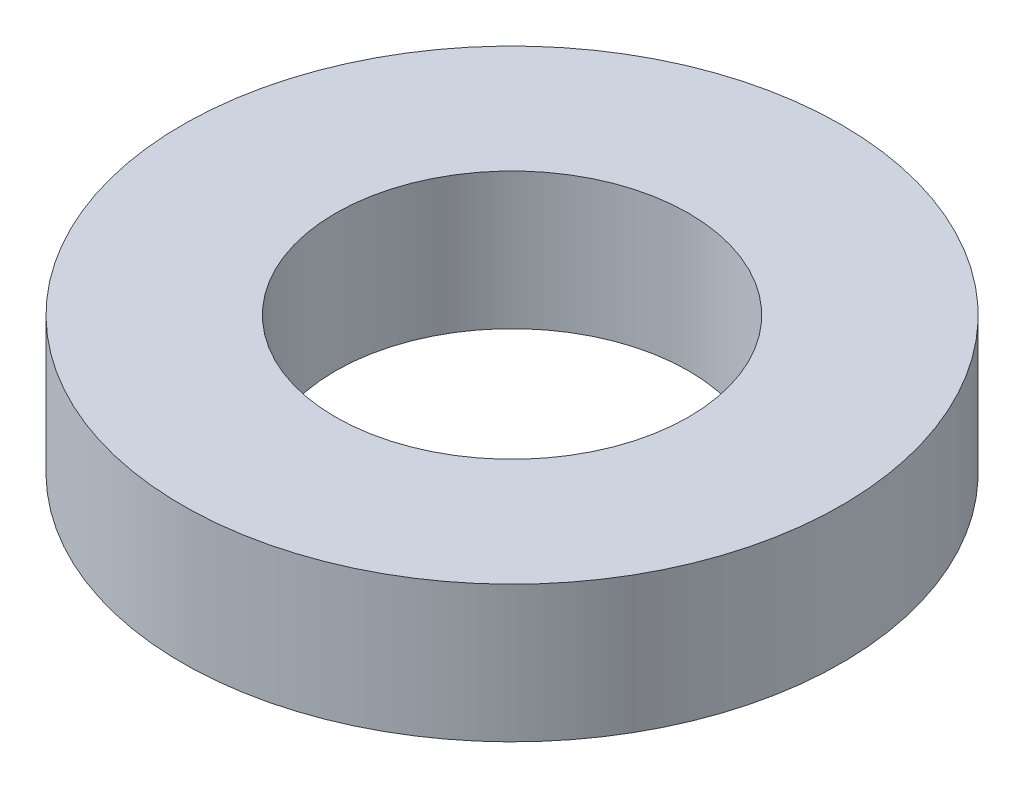
ISO-10303-21;
HEADER;
FILE_DESCRIPTION(('STEP AP214'),'2;1');
FILE_NAME('part.step','',(''),(''),'','','');
FILE_SCHEMA(('AUTOMOTIVE_DESIGN { 1 0 10303 214 1 1 1 1 }'));
ENDSEC;
DATA;
#1=APPLICATION_CONTEXT('core data for automotive mechanical design processes');
#2=APPLICATION_PROTOCOL_DEFINITION('international standard','automotive_design',2000,#1);
#3=PRODUCT_CONTEXT('',#1,'mechanical');
#4=PRODUCT('Part','Part','',(#3));
#5=PRODUCT_RELATED_PRODUCT_CATEGORY('part','',(#4));
#6=PRODUCT_DEFINITION_FORMATION('','',#4);
#7=PRODUCT_DEFINITION_CONTEXT('part definition',#1,'design');
#8=PRODUCT_DEFINITION('design','',#6,#7);
#9=PRODUCT_DEFINITION_SHAPE('','',#8);
#10=(LENGTH_UNIT() NAMED_UNIT(*) SI_UNIT(.MILLI.,.METRE.));
#11=(NAMED_UNIT(*) PLANE_ANGLE_UNIT() SI_UNIT($,.RADIAN.));
#12=(NAMED_UNIT(*) SI_UNIT($,.STERADIAN.) SOLID_ANGLE_UNIT());
#13=UNCERTAINTY_MEASURE_WITH_UNIT(LENGTH_MEASURE(1.E-05),#10,'distance_accuracy_value','');
#14=(GEOMETRIC_REPRESENTATION_CONTEXT(3) GLOBAL_UNCERTAINTY_ASSIGNED_CONTEXT((#13)) GLOBAL_UNIT_ASSIGNED_CONTEXT((#10,
#11,#12)) REPRESENTATION_CONTEXT('',''));
#15=CARTESIAN_POINT('',(0.,0.,0.));
#16=DIRECTION('',(0.,0.,1.));
#17=DIRECTION('',(1.,0.,0.));
#18=AXIS2_PLACEMENT_3D('',#15,#16,#17);
#19=CARTESIAN_POINT('',(0.,29.,0.));
#20=DIRECTION('',(0.,-1.,0.));
#21=DIRECTION('',(0.,0.,-1.));
#22=AXIS2_PLACEMENT_3D('',#19,#20,#21);
#23=CYLINDRICAL_SURFACE('',#22,70.);
#24=CARTESIAN_POINT('',(0.,29.,0.));
#25=DIRECTION('',(0.,1.,0.));
#26=DIRECTION('',(0.,0.,1.));
#27=AXIS2_PLACEMENT_3D('',#24,#25,#26);
#28=CIRCLE('',#27,70.);
#29=CARTESIAN_POINT('',(0.,29.,-70.));
#30=VERTEX_POINT('',#29);
#31=EDGE_CURVE('E10',#30,#30,#28,.T.);
#32=CARTESIAN_POINT('',(0.,0.,0.));
#33=DIRECTION('',(0.,1.,0.));
#34=DIRECTION('',(0.,0.,1.));
#35=AXIS2_PLACEMENT_3D('',#32,#33,#34);
#36=CIRCLE('',#35,70.);
#37=CARTESIAN_POINT('',(0.,0.,-70.));
#38=VERTEX_POINT('',#37);
#39=EDGE_CURVE('E37',#38,#38,#36,.T.);
#40=CARTESIAN_POINT('',(0.,29.,-70.));
#41=CARTESIAN_POINT('',(0.,28.6979166666667,-70.));
#42=CARTESIAN_POINT('',(0.,28.3958333333333,-70.));
#43=CARTESIAN_POINT('',(0.,27.7916666666667,-70.));
#44=CARTESIAN_POINT('',(0.,27.4895833333333,-70.));
#45=CARTESIAN_POINT('',(0.,26.8854166666667,-70.));
#46=CARTESIAN_POINT('',(0.,26.5833333333333,-70.));
#47=CARTESIAN_POINT('',(0.,25.9791666666667,-70.));
#48=CARTESIAN_POINT('',(0.,25.6770833333333,-70.));
#49=CARTESIAN_POINT('',(0.,25.0729166666667,-70.));
#50=CARTESIAN_POINT('',(0.,24.7708333333333,-70.));
#51=CARTESIAN_POINT('',(0.,24.1666666666667,-70.));
#52=CARTESIAN_POINT('',(0.,23.8645833333333,-70.));
#53=CARTESIAN_POINT('',(0.,23.2604166666667,-70.));
#54=CARTESIAN_POINT('',(0.,22.9583333333333,-70.));
#55=CARTESIAN_POINT('',(0.,22.3541666666667,-70.));
#56=CARTESIAN_POINT('',(0.,22.0520833333333,-70.));
#57=CARTESIAN_POINT('',(0.,21.4479166666667,-70.));
#58=CARTESIAN_POINT('',(0.,21.1458333333333,-70.));
#59=CARTESIAN_POINT('',(0.,20.5416666666667,-70.));
#60=CARTESIAN_POINT('',(0.,20.2395833333333,-70.));
#61=CARTESIAN_POINT('',(0.,19.6354166666667,-70.));
#62=CARTESIAN_POINT('',(0.,19.3333333333333,-70.));
#63=CARTESIAN_POINT('',(0.,18.7291666666667,-70.));
#64=CARTESIAN_POINT('',(0.,18.4270833333333,-70.));
#65=CARTESIAN_POINT('',(0.,17.8229166666667,-70.));
#66=CARTESIAN_POINT('',(0.,17.5208333333333,-70.));
#67=CARTESIAN_POINT('',(0.,16.9166666666667,-70.));
#68=CARTESIAN_POINT('',(0.,16.6145833333333,-70.));
#69=CARTESIAN_POINT('',(0.,16.0104166666667,-70.));
#70=CARTESIAN_POINT('',(0.,15.7083333333333,-70.));
#71=CARTESIAN_POINT('',(0.,15.1041666666667,-70.));
#72=CARTESIAN_POINT('',(0.,14.8020833333333,-70.));
#73=CARTESIAN_POINT('',(0.,14.1979166666667,-70.));
#74=CARTESIAN_POINT('',(0.,13.8958333333333,-70.));
#75=CARTESIAN_POINT('',(0.,13.2916666666667,-70.));
#76=CARTESIAN_POINT('',(0.,12.9895833333333,-70.));
#77=CARTESIAN_POINT('',(0.,12.3854166666667,-70.));
#78=CARTESIAN_POINT('',(0.,12.0833333333333,-70.));
#79=CARTESIAN_POINT('',(0.,11.4791666666667,-70.));
#80=CARTESIAN_POINT('',(0.,11.1770833333333,-70.));
#81=CARTESIAN_POINT('',(0.,10.5729166666667,-70.));
#82=CARTESIAN_POINT('',(0.,10.2708333333333,-70.));
#83=CARTESIAN_POINT('',(0.,9.66666666666667,-70.));
#84=CARTESIAN_POINT('',(0.,9.36458333333333,-70.));
#85=CARTESIAN_POINT('',(0.,8.76041666666667,-70.));
#86=CARTESIAN_POINT('',(0.,8.45833333333333,-70.));
#87=CARTESIAN_POINT('',(0.,7.85416666666667,-70.));
#88=CARTESIAN_POINT('',(0.,7.55208333333333,-70.));
#89=CARTESIAN_POINT('',(0.,6.94791666666667,-70.));
#90=CARTESIAN_POINT('',(0.,6.64583333333333,-70.));
#91=CARTESIAN_POINT('',(0.,6.04166666666667,-70.));
#92=CARTESIAN_POINT('',(0.,5.73958333333333,-70.));
#93=CARTESIAN_POINT('',(0.,5.13541666666667,-70.));
#94=CARTESIAN_POINT('',(0.,4.83333333333333,-70.));
#95=CARTESIAN_POINT('',(0.,4.22916666666667,-70.));
#96=CARTESIAN_POINT('',(0.,3.92708333333333,-70.));
#97=CARTESIAN_POINT('',(0.,3.32291666666667,-70.));
#98=CARTESIAN_POINT('',(0.,3.02083333333333,-70.));
#99=CARTESIAN_POINT('',(0.,2.41666666666667,-70.));
#100=CARTESIAN_POINT('',(0.,2.11458333333333,-70.));
#101=CARTESIAN_POINT('',(0.,1.51041666666667,-70.));
#102=CARTESIAN_POINT('',(0.,1.20833333333333,-70.));
#103=CARTESIAN_POINT('',(0.,0.604166666666667,-70.));
#104=CARTESIAN_POINT('',(0.,0.302083333333333,-70.));
#105=CARTESIAN_POINT('',(0.,0.,-70.));
#106=B_SPLINE_CURVE_WITH_KNOTS('',3,(#40,#41,#42,#43,#44,#45,#46,#47,#48,#49,#50,#51,#52,#53,
#54,#55,#56,#57,#58,#59,#60,#61,#62,#63,#64,#65,#66,#67,#68,#69,#70,#71,#72,#73,#74,#75,#76,#77,
#78,#79,#80,#81,#82,#83,#84,#85,#86,#87,#88,#89,#90,#91,#92,#93,#94,#95,#96,#97,#98,#99,#100,
#101,#102,#103,#104,#105),.UNSPECIFIED.,.F.,.F.,(4,2,2,2,2,2,2,2,2,2,2,2,2,2,2,2,2,2,2,2,2,2,2,
2,2,2,2,2,2,2,2,2,4),(0.,0.906250000000001,1.8125,2.71875,3.625,4.53125,5.4375,6.34375,7.25,
8.15625,9.0625,9.96875,10.875,11.78125,12.6875,13.59375,14.5,15.40625,16.3125,17.21875,18.125,
19.03125,19.9375,20.84375,21.75,22.65625,23.5625,24.46875,25.375,26.28125,27.1875,28.09375,29.),.UNSPECIFIED.);
#107=EDGE_CURVE('BSEAM40',#30,#38,#106,.T.);
#108=ORIENTED_EDGE('',*,*,#31,.F.);
#109=ORIENTED_EDGE('',*,*,#39,.T.);
#110=ORIENTED_EDGE('',*,*,#107,.T.);
#111=ORIENTED_EDGE('',*,*,#107,.F.);
#112=EDGE_LOOP('',(#108,#110,#109,#111));
#113=FACE_BOUND('',#112,.T.);
#114=ADVANCED_FACE('F40',(#113),#23,.T.);
#115=CARTESIAN_POINT('',(0.,29.,0.));
#116=DIRECTION('',(0.,1.,0.));
#117=DIRECTION('',(0.,0.,1.));
#118=AXIS2_PLACEMENT_3D('',#115,#116,#117);
#119=PLANE('',#118);
#120=CARTESIAN_POINT('',(0.,29.,0.));
#121=DIRECTION('',(0.,1.,0.));
#122=DIRECTION('',(0.,0.,1.));
#123=AXIS2_PLACEMENT_3D('',#120,#121,#122);
#124=CIRCLE('',#123,37.5);
#125=CARTESIAN_POINT('',(0.,29.,-37.5));
#126=VERTEX_POINT('',#125);
#127=EDGE_CURVE('E50',#126,#126,#124,.T.);
#128=ORIENTED_EDGE('',*,*,#127,.F.);
#129=EDGE_LOOP('',(#128));
#130=FACE_BOUND('',#129,.T.);
#131=ORIENTED_EDGE('',*,*,#31,.T.);
#132=EDGE_LOOP('',(#131));
#133=FACE_BOUND('',#132,.T.);
#134=ADVANCED_FACE('F59',(#130,#133),#119,.T.);
#135=CARTESIAN_POINT('',(0.,0.,0.));
#136=DIRECTION('',(0.,1.,0.));
#137=DIRECTION('',(0.,0.,1.));
#138=AXIS2_PLACEMENT_3D('',#135,#136,#137);
#139=PLANE('',#138);
#140=CARTESIAN_POINT('',(0.,0.,0.));
#141=DIRECTION('',(0.,1.,0.));
#142=DIRECTION('',(0.,0.,1.));
#143=AXIS2_PLACEMENT_3D('',#140,#141,#142);
#144=CIRCLE('',#143,37.5);
#145=CARTESIAN_POINT('',(0.,0.,-37.5));
#146=VERTEX_POINT('',#145);
#147=EDGE_CURVE('E47',#146,#146,#144,.T.);
#148=ORIENTED_EDGE('',*,*,#147,.T.);
#149=EDGE_LOOP('',(#148));
#150=FACE_BOUND('',#149,.T.);
#151=ORIENTED_EDGE('',*,*,#39,.F.);
#152=EDGE_LOOP('',(#151));
#153=FACE_BOUND('',#152,.T.);
#154=ADVANCED_FACE('F58',(#150,#153),#139,.F.);
#155=CARTESIAN_POINT('',(0.,29.,0.));
#156=DIRECTION('',(0.,-1.,0.));
#157=DIRECTION('',(0.,0.,-1.));
#158=AXIS2_PLACEMENT_3D('',#155,#156,#157);
#159=CYLINDRICAL_SURFACE('',#158,37.5);
#160=CARTESIAN_POINT('',(0.,29.,-37.5));
#161=CARTESIAN_POINT('',(0.,28.6979166666667,-37.5));
#162=CARTESIAN_POINT('',(0.,28.3958333333333,-37.5));
#163=CARTESIAN_POINT('',(0.,27.7916666666667,-37.5));
#164=CARTESIAN_POINT('',(0.,27.4895833333333,-37.5));
#165=CARTESIAN_POINT('',(0.,26.8854166666667,-37.5));
#166=CARTESIAN_POINT('',(0.,26.5833333333333,-37.5));
#167=CARTESIAN_POINT('',(0.,25.9791666666667,-37.5));
#168=CARTESIAN_POINT('',(0.,25.6770833333333,-37.5));
#169=CARTESIAN_POINT('',(0.,25.0729166666667,-37.5));
#170=CARTESIAN_POINT('',(0.,24.7708333333333,-37.5));
#171=CARTESIAN_POINT('',(0.,24.1666666666667,-37.5));
#172=CARTESIAN_POINT('',(0.,23.8645833333333,-37.5));
#173=CARTESIAN_POINT('',(0.,23.2604166666667,-37.5));
#174=CARTESIAN_POINT('',(0.,22.9583333333333,-37.5));
#175=CARTESIAN_POINT('',(0.,22.3541666666667,-37.5));
#176=CARTESIAN_POINT('',(0.,22.0520833333333,-37.5));
#177=CARTESIAN_POINT('',(0.,21.4479166666667,-37.5));
#178=CARTESIAN_POINT('',(0.,21.1458333333333,-37.5));
#179=CARTESIAN_POINT('',(0.,20.5416666666667,-37.5));
#180=CARTESIAN_POINT('',(0.,20.2395833333333,-37.5));
#181=CARTESIAN_POINT('',(0.,19.6354166666667,-37.5));
#182=CARTESIAN_POINT('',(0.,19.3333333333333,-37.5));
#183=CARTESIAN_POINT('',(0.,18.7291666666667,-37.5));
#184=CARTESIAN_POINT('',(0.,18.4270833333333,-37.5));
#185=CARTESIAN_POINT('',(0.,17.8229166666667,-37.5));
#186=CARTESIAN_POINT('',(0.,17.5208333333333,-37.5));
#187=CARTESIAN_POINT('',(0.,16.9166666666667,-37.5));
#188=CARTESIAN_POINT('',(0.,16.6145833333333,-37.5));
#189=CARTESIAN_POINT('',(0.,16.0104166666667,-37.5));
#190=CARTESIAN_POINT('',(0.,15.7083333333333,-37.5));
#191=CARTESIAN_POINT('',(0.,15.1041666666667,-37.5));
#192=CARTESIAN_POINT('',(0.,14.8020833333333,-37.5));
#193=CARTESIAN_POINT('',(0.,14.1979166666667,-37.5));
#194=CARTESIAN_POINT('',(0.,13.8958333333333,-37.5));
#195=CARTESIAN_POINT('',(0.,13.2916666666667,-37.5));
#196=CARTESIAN_POINT('',(0.,12.9895833333333,-37.5));
#197=CARTESIAN_POINT('',(0.,12.3854166666667,-37.5));
#198=CARTESIAN_POINT('',(0.,12.0833333333333,-37.5));
#199=CARTESIAN_POINT('',(0.,11.4791666666667,-37.5));
#200=CARTESIAN_POINT('',(0.,11.1770833333333,-37.5));
#201=CARTESIAN_POINT('',(0.,10.5729166666667,-37.5));
#202=CARTESIAN_POINT('',(0.,10.2708333333333,-37.5));
#203=CARTESIAN_POINT('',(0.,9.66666666666667,-37.5));
#204=CARTESIAN_POINT('',(0.,9.36458333333333,-37.5));
#205=CARTESIAN_POINT('',(0.,8.76041666666667,-37.5));
#206=CARTESIAN_POINT('',(0.,8.45833333333333,-37.5));
#207=CARTESIAN_POINT('',(0.,7.85416666666667,-37.5));
#208=CARTESIAN_POINT('',(0.,7.55208333333333,-37.5));
#209=CARTESIAN_POINT('',(0.,6.94791666666667,-37.5));
#210=CARTESIAN_POINT('',(0.,6.64583333333333,-37.5));
#211=CARTESIAN_POINT('',(0.,6.04166666666667,-37.5));
#212=CARTESIAN_POINT('',(0.,5.73958333333333,-37.5));
#213=CARTESIAN_POINT('',(0.,5.13541666666667,-37.5));
#214=CARTESIAN_POINT('',(0.,4.83333333333333,-37.5));
#215=CARTESIAN_POINT('',(0.,4.22916666666667,-37.5));
#216=CARTESIAN_POINT('',(0.,3.92708333333333,-37.5));
#217=CARTESIAN_POINT('',(0.,3.32291666666667,-37.5));
#218=CARTESIAN_POINT('',(0.,3.02083333333333,-37.5));
#219=CARTESIAN_POINT('',(0.,2.41666666666667,-37.5));
#220=CARTESIAN_POINT('',(0.,2.11458333333333,-37.5));
#221=CARTESIAN_POINT('',(0.,1.51041666666667,-37.5));
#222=CARTESIAN_POINT('',(0.,1.20833333333333,-37.5));
#223=CARTESIAN_POINT('',(0.,0.604166666666667,-37.5));
#224=CARTESIAN_POINT('',(0.,0.302083333333333,-37.5));
#225=CARTESIAN_POINT('',(0.,0.,-37.5));
#226=B_SPLINE_CURVE_WITH_KNOTS('',3,(#160,#161,#162,#163,#164,#165,#166,#167,#168,#169,#170,
#171,#172,#173,#174,#175,#176,#177,#178,#179,#180,#181,#182,#183,#184,#185,#186,#187,#188,#189,
#190,#191,#192,#193,#194,#195,#196,#197,#198,#199,#200,#201,#202,#203,#204,#205,#206,#207,#208,
#209,#210,#211,#212,#213,#214,#215,#216,#217,#218,#219,#220,#221,#222,#223,#224,#225),
.UNSPECIFIED.,.F.,.F.,(4,2,2,2,2,2,2,2,2,2,2,2,2,2,2,2,2,2,2,2,2,2,2,2,2,2,2,2,2,2,2,2,4),(0.,
0.906249999999997,1.8125,2.71875,3.625,4.53125,5.4375,6.34375,7.25,8.15625,9.0625,9.96875,
10.875,11.78125,12.6875,13.59375,14.5,15.40625,16.3125,17.21875,18.125,19.03125,19.9375,
20.84375,21.75,22.65625,23.5625,24.46875,25.375,26.28125,27.1875,28.09375,29.),.UNSPECIFIED.);
#227=EDGE_CURVE('BSEAM54',#126,#146,#226,.T.);
#228=ORIENTED_EDGE('',*,*,#127,.T.);
#229=ORIENTED_EDGE('',*,*,#147,.F.);
#230=ORIENTED_EDGE('',*,*,#227,.T.);
#231=ORIENTED_EDGE('',*,*,#227,.F.);
#232=EDGE_LOOP('',(#228,#230,#229,#231));
#233=FACE_BOUND('',#232,.T.);
#234=ADVANCED_FACE('F54',(#233),#159,.F.);
#235=CLOSED_SHELL('',(#114,#134,#154,#234));
#236=MANIFOLD_SOLID_BREP('B2',#235);
#237=ADVANCED_BREP_SHAPE_REPRESENTATION('',(#18,#236),#14);
#238=SHAPE_DEFINITION_REPRESENTATION(#9,#237);
ENDSEC;
END-ISO-10303-21;
